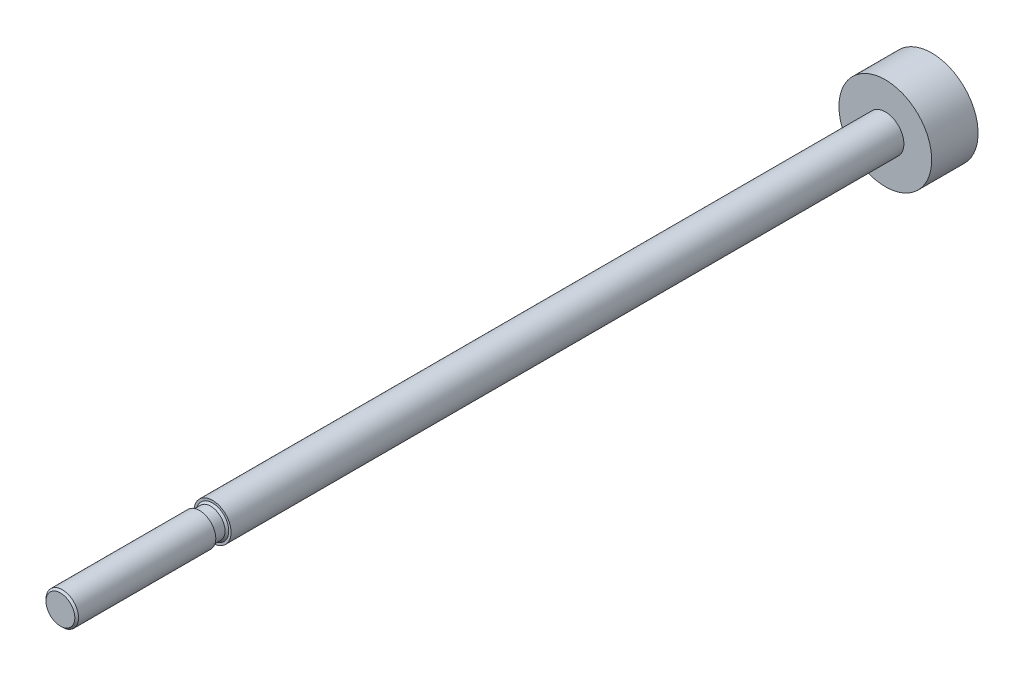
ISO-10303-21;
HEADER;
FILE_DESCRIPTION(('STEP AP214'),'2;1');
FILE_NAME('part.step','',(''),(''),'','','');
FILE_SCHEMA(('AUTOMOTIVE_DESIGN { 1 0 10303 214 1 1 1 1 }'));
ENDSEC;
DATA;
#1=APPLICATION_CONTEXT('core data for automotive mechanical design processes');
#2=APPLICATION_PROTOCOL_DEFINITION('international standard','automotive_design',2000,#1);
#3=PRODUCT_CONTEXT('',#1,'mechanical');
#4=PRODUCT('Part','Part','',(#3));
#5=PRODUCT_RELATED_PRODUCT_CATEGORY('part','',(#4));
#6=PRODUCT_DEFINITION_FORMATION('','',#4);
#7=PRODUCT_DEFINITION_CONTEXT('part definition',#1,'design');
#8=PRODUCT_DEFINITION('design','',#6,#7);
#9=PRODUCT_DEFINITION_SHAPE('','',#8);
#10=(LENGTH_UNIT() NAMED_UNIT(*) SI_UNIT(.MILLI.,.METRE.));
#11=(NAMED_UNIT(*) PLANE_ANGLE_UNIT() SI_UNIT($,.RADIAN.));
#12=(NAMED_UNIT(*) SI_UNIT($,.STERADIAN.) SOLID_ANGLE_UNIT());
#13=UNCERTAINTY_MEASURE_WITH_UNIT(LENGTH_MEASURE(1.E-05),#10,'distance_accuracy_value','');
#14=(GEOMETRIC_REPRESENTATION_CONTEXT(3) GLOBAL_UNCERTAINTY_ASSIGNED_CONTEXT((#13)) GLOBAL_UNIT_ASSIGNED_CONTEXT((#10,
#11,#12)) REPRESENTATION_CONTEXT('',''));
#15=CARTESIAN_POINT('',(0.,0.,0.));
#16=DIRECTION('',(0.,0.,1.));
#17=DIRECTION('',(1.,0.,0.));
#18=AXIS2_PLACEMENT_3D('',#15,#16,#17);
#19=CARTESIAN_POINT('',(0.,0.,91.44));
#20=DIRECTION('',(0.,0.,-1.));
#21=DIRECTION('',(-1.,0.,0.));
#22=AXIS2_PLACEMENT_3D('',#19,#20,#21);
#23=PLANE('',#22);
#24=CARTESIAN_POINT('',(0.,0.,91.4399999999773));
#25=DIRECTION('',(0.,0.,-1.));
#26=DIRECTION('',(-1.,0.,0.));
#27=AXIS2_PLACEMENT_3D('',#24,#25,#26);
#28=CIRCLE('',#27,1.55250000000251);
#29=CARTESIAN_POINT('',(-1.55250000000251,0.,91.4399999999773));
#30=VERTEX_POINT('',#29);
#31=EDGE_CURVE('E18',#30,#30,#28,.T.);
#32=ORIENTED_EDGE('',*,*,#31,.F.);
#33=EDGE_LOOP('',(#32));
#34=FACE_BOUND('',#33,.T.);
#35=ADVANCED_FACE('F15',(#34),#23,.F.);
#36=CARTESIAN_POINT('',(0.,0.,91.2400000000275));
#37=DIRECTION('',(0.,0.,-1.));
#38=DIRECTION('',(-1.,0.,0.));
#39=AXIS2_PLACEMENT_3D('',#36,#37,#38);
#40=CONICAL_SURFACE('',#39,1.75249999995231,0.785398163397448);
#41=CARTESIAN_POINT('',(0.,0.,91.24));
#42=DIRECTION('',(0.,0.,-1.));
#43=DIRECTION('',(-1.,0.,0.));
#44=AXIS2_PLACEMENT_3D('',#41,#42,#43);
#45=CIRCLE('',#44,1.75249999999999);
#46=CARTESIAN_POINT('',(-1.75249999999999,0.,91.24));
#47=VERTEX_POINT('',#46);
#48=EDGE_CURVE('E30',#47,#47,#45,.T.);
#49=ORIENTED_EDGE('',*,*,#48,.F.);
#50=EDGE_LOOP('',(#49));
#51=FACE_BOUND('',#50,.T.);
#52=ORIENTED_EDGE('',*,*,#31,.T.);
#53=EDGE_LOOP('',(#52));
#54=FACE_BOUND('',#53,.T.);
#55=ADVANCED_FACE('F54',(#51,#54),#40,.T.);
#56=CARTESIAN_POINT('',(0.,0.,0.));
#57=DIRECTION('',(0.,0.,-1.));
#58=DIRECTION('',(-1.,0.,0.));
#59=AXIS2_PLACEMENT_3D('',#56,#57,#58);
#60=CYLINDRICAL_SURFACE('',#59,1.75249999999999);
#61=CARTESIAN_POINT('',(0.,0.,76.44));
#62=DIRECTION('',(0.,0.,-1.));
#63=DIRECTION('',(-1.,0.,0.));
#64=AXIS2_PLACEMENT_3D('',#61,#62,#63);
#65=CIRCLE('',#64,1.75249999999999);
#66=CARTESIAN_POINT('',(-1.75249999999999,0.,76.44));
#67=VERTEX_POINT('',#66);
#68=EDGE_CURVE('E44',#67,#67,#65,.F.);
#69=ORIENTED_EDGE('',*,*,#68,.T.);
#70=EDGE_LOOP('',(#69));
#71=FACE_BOUND('',#70,.T.);
#72=ORIENTED_EDGE('',*,*,#48,.T.);
#73=EDGE_LOOP('',(#72));
#74=FACE_BOUND('',#73,.T.);
#75=ADVANCED_FACE('F61',(#71,#74),#60,.T.);
#76=CARTESIAN_POINT('',(0.,1.75249999999999,76.44));
#77=DIRECTION('',(0.,0.,1.));
#78=DIRECTION('',(1.,0.,0.));
#79=AXIS2_PLACEMENT_3D('',#76,#77,#78);
#80=PLANE('',#79);
#81=ORIENTED_EDGE('',*,*,#68,.F.);
#82=EDGE_LOOP('',(#81));
#83=FACE_BOUND('',#82,.T.);
#84=CARTESIAN_POINT('',(0.,0.,76.44));
#85=DIRECTION('',(0.,0.,-1.));
#86=DIRECTION('',(-1.,0.,0.));
#87=AXIS2_PLACEMENT_3D('',#84,#85,#86);
#88=CIRCLE('',#87,1.54999999999999);
#89=CARTESIAN_POINT('',(-1.54999999999999,0.,76.44));
#90=VERTEX_POINT('',#89);
#91=EDGE_CURVE('E42',#90,#90,#88,.T.);
#92=ORIENTED_EDGE('',*,*,#91,.F.);
#93=EDGE_LOOP('',(#92));
#94=FACE_BOUND('',#93,.T.);
#95=ADVANCED_FACE('F93',(#83,#94),#80,.F.);
#96=CARTESIAN_POINT('',(0.,0.,0.));
#97=DIRECTION('',(0.,0.,-1.));
#98=DIRECTION('',(-1.,0.,0.));
#99=AXIS2_PLACEMENT_3D('',#96,#97,#98);
#100=CYLINDRICAL_SURFACE('',#99,1.54999999999999);
#101=CARTESIAN_POINT('',(0.,0.,75.240000000008));
#102=DIRECTION('',(0.,0.,-1.));
#103=DIRECTION('',(-1.,0.,0.));
#104=AXIS2_PLACEMENT_3D('',#101,#102,#103);
#105=CIRCLE('',#104,1.55000000000882);
#106=CARTESIAN_POINT('',(-1.55000000000882,0.,75.240000000008));
#107=VERTEX_POINT('',#106);
#108=EDGE_CURVE('E41',#107,#107,#105,.T.);
#109=ORIENTED_EDGE('',*,*,#108,.F.);
#110=EDGE_LOOP('',(#109));
#111=FACE_BOUND('',#110,.T.);
#112=ORIENTED_EDGE('',*,*,#91,.T.);
#113=EDGE_LOOP('',(#112));
#114=FACE_BOUND('',#113,.T.);
#115=ADVANCED_FACE('F89',(#111,#114),#100,.T.);
#116=CARTESIAN_POINT('',(0.,0.,-2.5));
#117=DIRECTION('',(0.,0.,1.));
#118=DIRECTION('',(1.,0.,0.));
#119=AXIS2_PLACEMENT_3D('',#116,#117,#118);
#120=PLANE('',#119);
#121=CARTESIAN_POINT('',(0.,0.,-2.5));
#122=DIRECTION('',(0.,0.,-1.));
#123=DIRECTION('',(-1.,0.,0.));
#124=AXIS2_PLACEMENT_3D('',#121,#122,#123);
#125=CIRCLE('',#124,5.);
#126=CARTESIAN_POINT('',(-5.,0.,-2.5));
#127=VERTEX_POINT('',#126);
#128=EDGE_CURVE('E38',#127,#127,#125,.F.);
#129=ORIENTED_EDGE('',*,*,#128,.F.);
#130=EDGE_LOOP('',(#129));
#131=FACE_BOUND('',#130,.T.);
#132=ADVANCED_FACE('F85',(#131),#120,.F.);
#133=CARTESIAN_POINT('',(0.,0.,75.0400000000013));
#134=DIRECTION('',(0.,0.,-1.));
#135=DIRECTION('',(-1.,0.,0.));
#136=AXIS2_PLACEMENT_3D('',#133,#134,#135);
#137=CONICAL_SURFACE('',#136,1.75000000001546,0.785398163397448);
#138=CARTESIAN_POINT('',(0.,0.,75.0400000000013));
#139=DIRECTION('',(0.,0.,-1.));
#140=DIRECTION('',(-1.,0.,0.));
#141=AXIS2_PLACEMENT_3D('',#138,#139,#140);
#142=CIRCLE('',#141,1.75000000001546);
#143=CARTESIAN_POINT('',(-1.75000000001546,0.,75.0400000000013));
#144=VERTEX_POINT('',#143);
#145=EDGE_CURVE('E35',#144,#144,#142,.F.);
#146=ORIENTED_EDGE('',*,*,#145,.T.);
#147=EDGE_LOOP('',(#146));
#148=FACE_BOUND('',#147,.T.);
#149=ORIENTED_EDGE('',*,*,#108,.T.);
#150=EDGE_LOOP('',(#149));
#151=FACE_BOUND('',#150,.T.);
#152=ADVANCED_FACE('F81',(#148,#151),#137,.T.);
#153=CARTESIAN_POINT('',(0.,0.,2.5));
#154=DIRECTION('',(0.,0.,-1.));
#155=DIRECTION('',(-1.,0.,0.));
#156=AXIS2_PLACEMENT_3D('',#153,#154,#155);
#157=CYLINDRICAL_SURFACE('',#156,5.);
#158=ORIENTED_EDGE('',*,*,#128,.T.);
#159=EDGE_LOOP('',(#158));
#160=FACE_BOUND('',#159,.T.);
#161=CARTESIAN_POINT('',(0.,0.,2.5));
#162=DIRECTION('',(0.,0.,-1.));
#163=DIRECTION('',(-1.,0.,0.));
#164=AXIS2_PLACEMENT_3D('',#161,#162,#163);
#165=CIRCLE('',#164,5.);
#166=CARTESIAN_POINT('',(-5.,0.,2.5));
#167=VERTEX_POINT('',#166);
#168=EDGE_CURVE('E27',#167,#167,#165,.F.);
#169=ORIENTED_EDGE('',*,*,#168,.F.);
#170=EDGE_LOOP('',(#169));
#171=FACE_BOUND('',#170,.T.);
#172=ADVANCED_FACE('F77',(#160,#171),#157,.T.);
#173=CARTESIAN_POINT('',(0.,1.75,75.04));
#174=DIRECTION('',(0.,0.,-1.));
#175=DIRECTION('',(-1.,0.,0.));
#176=AXIS2_PLACEMENT_3D('',#173,#174,#175);
#177=PLANE('',#176);
#178=CARTESIAN_POINT('',(0.,0.,75.04));
#179=DIRECTION('',(0.,0.,-1.));
#180=DIRECTION('',(-1.,0.,0.));
#181=AXIS2_PLACEMENT_3D('',#178,#179,#180);
#182=CIRCLE('',#181,2.);
#183=CARTESIAN_POINT('',(-2.,0.,75.04));
#184=VERTEX_POINT('',#183);
#185=EDGE_CURVE('E22',#184,#184,#182,.T.);
#186=ORIENTED_EDGE('',*,*,#185,.F.);
#187=EDGE_LOOP('',(#186));
#188=FACE_BOUND('',#187,.T.);
#189=ORIENTED_EDGE('',*,*,#145,.F.);
#190=EDGE_LOOP('',(#189));
#191=FACE_BOUND('',#190,.T.);
#192=ADVANCED_FACE('F70',(#188,#191),#177,.F.);
#193=CARTESIAN_POINT('',(0.,0.,2.5));
#194=DIRECTION('',(0.,0.,1.));
#195=DIRECTION('',(1.,0.,0.));
#196=AXIS2_PLACEMENT_3D('',#193,#194,#195);
#197=PLANE('',#196);
#198=CARTESIAN_POINT('',(0.,0.,2.5));
#199=DIRECTION('',(0.,0.,-1.));
#200=DIRECTION('',(-1.,0.,0.));
#201=AXIS2_PLACEMENT_3D('',#198,#199,#200);
#202=CIRCLE('',#201,2.);
#203=CARTESIAN_POINT('',(-2.,0.,2.5));
#204=VERTEX_POINT('',#203);
#205=EDGE_CURVE('E10',#204,#204,#202,.F.);
#206=ORIENTED_EDGE('',*,*,#205,.F.);
#207=EDGE_LOOP('',(#206));
#208=FACE_BOUND('',#207,.T.);
#209=ORIENTED_EDGE('',*,*,#168,.T.);
#210=EDGE_LOOP('',(#209));
#211=FACE_BOUND('',#210,.T.);
#212=ADVANCED_FACE('F65',(#208,#211),#197,.T.);
#213=CARTESIAN_POINT('',(0.,0.,97.0968542494924));
#214=DIRECTION('',(0.,0.,-1.));
#215=DIRECTION('',(-1.,0.,0.));
#216=AXIS2_PLACEMENT_3D('',#213,#214,#215);
#217=CYLINDRICAL_SURFACE('',#216,2.);
#218=ORIENTED_EDGE('',*,*,#205,.T.);
#219=EDGE_LOOP('',(#218));
#220=FACE_BOUND('',#219,.T.);
#221=ORIENTED_EDGE('',*,*,#185,.T.);
#222=EDGE_LOOP('',(#221));
#223=FACE_BOUND('',#222,.T.);
#224=ADVANCED_FACE('F63',(#220,#223),#217,.T.);
#225=CLOSED_SHELL('',(#35,#55,#75,#95,#115,#132,#152,#172,#192,#212,#224));
#226=MANIFOLD_SOLID_BREP('B1',#225);
#227=ADVANCED_BREP_SHAPE_REPRESENTATION('',(#18,#226),#14);
#228=SHAPE_DEFINITION_REPRESENTATION(#9,#227);
ENDSEC;
END-ISO-10303-21;
